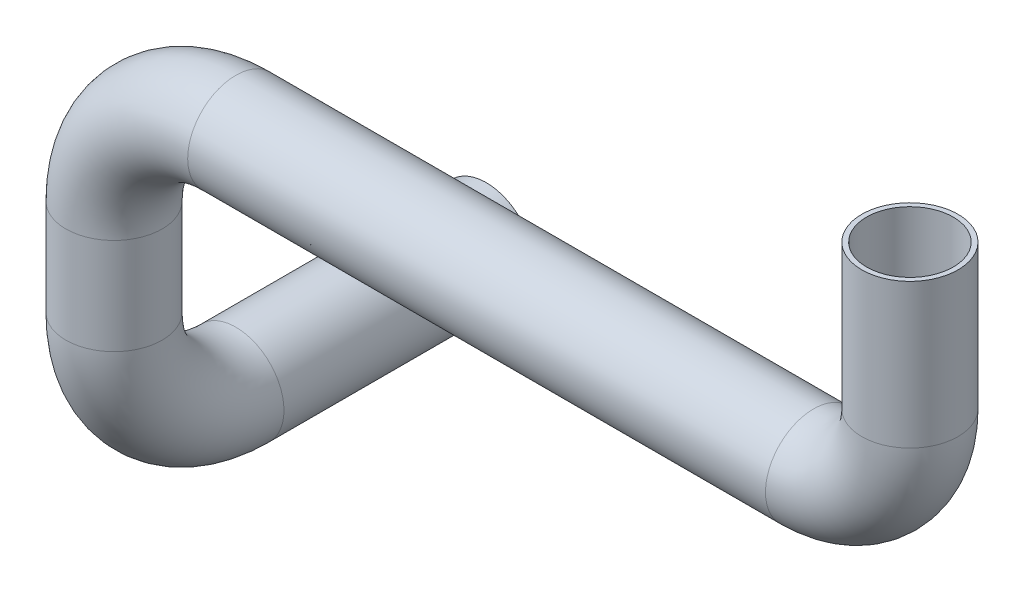
ISO-10303-21;
HEADER;
FILE_DESCRIPTION(('STEP AP214'),'2;1');
FILE_NAME('part.step','',(''),(''),'','','');
FILE_SCHEMA(('AUTOMOTIVE_DESIGN { 1 0 10303 214 1 1 1 1 }'));
ENDSEC;
DATA;
#1=APPLICATION_CONTEXT('core data for automotive mechanical design processes');
#2=APPLICATION_PROTOCOL_DEFINITION('international standard','automotive_design',2000,#1);
#3=PRODUCT_CONTEXT('',#1,'mechanical');
#4=PRODUCT('Part','Part','',(#3));
#5=PRODUCT_RELATED_PRODUCT_CATEGORY('part','',(#4));
#6=PRODUCT_DEFINITION_FORMATION('','',#4);
#7=PRODUCT_DEFINITION_CONTEXT('part definition',#1,'design');
#8=PRODUCT_DEFINITION('design','',#6,#7);
#9=PRODUCT_DEFINITION_SHAPE('','',#8);
#10=(LENGTH_UNIT() NAMED_UNIT(*) SI_UNIT(.MILLI.,.METRE.));
#11=(NAMED_UNIT(*) PLANE_ANGLE_UNIT() SI_UNIT($,.RADIAN.));
#12=(NAMED_UNIT(*) SI_UNIT($,.STERADIAN.) SOLID_ANGLE_UNIT());
#13=UNCERTAINTY_MEASURE_WITH_UNIT(LENGTH_MEASURE(1.E-05),#10,'distance_accuracy_value','');
#14=(GEOMETRIC_REPRESENTATION_CONTEXT(3) GLOBAL_UNCERTAINTY_ASSIGNED_CONTEXT((#13)) GLOBAL_UNIT_ASSIGNED_CONTEXT((#10,
#11,#12)) REPRESENTATION_CONTEXT('',''));
#15=CARTESIAN_POINT('',(0.,0.,0.));
#16=DIRECTION('',(0.,0.,1.));
#17=DIRECTION('',(1.,0.,0.));
#18=AXIS2_PLACEMENT_3D('',#15,#16,#17);
#19=CARTESIAN_POINT('',(-42.65,-12.65,0.));
#20=DIRECTION('',(0.,-1.,0.));
#21=DIRECTION('',(1.,0.,0.));
#22=AXIS2_PLACEMENT_3D('',#19,#20,#21);
#23=CYLINDRICAL_SURFACE('',#22,5.);
#24=CARTESIAN_POINT('',(-42.65,-12.65,0.));
#25=DIRECTION('',(0.,1.,0.));
#26=DIRECTION('',(0.,0.,1.));
#27=AXIS2_PLACEMENT_3D('',#24,#25,#26);
#28=CIRCLE('',#27,5.);
#29=CARTESIAN_POINT('',(-47.65,-12.65,0.));
#30=VERTEX_POINT('',#29);
#31=EDGE_CURVE('E10',#30,#30,#28,.T.);
#32=ORIENTED_EDGE('',*,*,#31,.F.);
#33=EDGE_LOOP('',(#32));
#34=FACE_BOUND('',#33,.T.);
#35=CARTESIAN_POINT('',(-42.65,-22.65,0.));
#36=DIRECTION('',(0.,-1.,0.));
#37=DIRECTION('',(1.,0.,0.));
#38=AXIS2_PLACEMENT_3D('',#35,#36,#37);
#39=CIRCLE('',#38,5.);
#40=CARTESIAN_POINT('',(-42.65,-22.65,4.99999999999999));
#41=VERTEX_POINT('',#40);
#42=EDGE_CURVE('E59',#41,#41,#39,.T.);
#43=ORIENTED_EDGE('',*,*,#42,.F.);
#44=EDGE_LOOP('',(#43));
#45=FACE_BOUND('',#44,.T.);
#46=ADVANCED_FACE('F31',(#34,#45),#23,.T.);
#47=CARTESIAN_POINT('',(-30.,-12.65,0.));
#48=DIRECTION('',(0.,0.,1.));
#49=DIRECTION('',(1.,0.,0.));
#50=AXIS2_PLACEMENT_3D('',#47,#48,#49);
#51=TOROIDAL_SURFACE('',#50,12.65,5.);
#52=CARTESIAN_POINT('',(-30.,0.,0.));
#53=DIRECTION('',(1.,0.,0.));
#54=DIRECTION('',(0.,0.,1.));
#55=AXIS2_PLACEMENT_3D('',#52,#53,#54);
#56=CIRCLE('',#55,5.);
#57=CARTESIAN_POINT('',(-30.,4.99999999999999,0.));
#58=VERTEX_POINT('',#57);
#59=EDGE_CURVE('E37',#58,#58,#56,.T.);
#60=CARTESIAN_POINT('',(-30.,-12.65,0.));
#61=DIRECTION('',(0.,0.,1.));
#62=DIRECTION('',(1.,0.,0.));
#63=AXIS2_PLACEMENT_3D('',#60,#61,#62);
#64=CIRCLE('',#63,17.65);
#65=EDGE_CURVE('',#58,#30,#64,.T.);
#66=ORIENTED_EDGE('',*,*,#59,.F.);
#67=ORIENTED_EDGE('',*,*,#31,.T.);
#68=ORIENTED_EDGE('',*,*,#65,.T.);
#69=ORIENTED_EDGE('',*,*,#65,.F.);
#70=EDGE_LOOP('',(#66,#68,#67,#69));
#71=FACE_BOUND('',#70,.T.);
#72=ADVANCED_FACE('F105',(#71),#51,.T.);
#73=CARTESIAN_POINT('',(30.,0.,0.));
#74=DIRECTION('',(-1.,0.,0.));
#75=DIRECTION('',(0.,-1.,0.));
#76=AXIS2_PLACEMENT_3D('',#73,#74,#75);
#77=CYLINDRICAL_SURFACE('',#76,5.);
#78=CARTESIAN_POINT('',(30.,0.,0.));
#79=DIRECTION('',(1.,0.,0.));
#80=DIRECTION('',(0.,0.,1.));
#81=AXIS2_PLACEMENT_3D('',#78,#79,#80);
#82=CIRCLE('',#81,5.);
#83=CARTESIAN_POINT('',(30.,-4.99999999999999,0.));
#84=VERTEX_POINT('',#83);
#85=EDGE_CURVE('E41',#84,#84,#82,.T.);
#86=ORIENTED_EDGE('',*,*,#85,.F.);
#87=EDGE_LOOP('',(#86));
#88=FACE_BOUND('',#87,.T.);
#89=ORIENTED_EDGE('',*,*,#59,.T.);
#90=EDGE_LOOP('',(#89));
#91=FACE_BOUND('',#90,.T.);
#92=ADVANCED_FACE('F110',(#88,#91),#77,.T.);
#93=CARTESIAN_POINT('',(30.,10.,0.));
#94=DIRECTION('',(0.,0.,-1.));
#95=DIRECTION('',(-1.,0.,0.));
#96=AXIS2_PLACEMENT_3D('',#93,#94,#95);
#97=TOROIDAL_SURFACE('',#96,9.99999999999999,5.);
#98=CARTESIAN_POINT('',(40.,10.,0.));
#99=DIRECTION('',(0.,1.,0.));
#100=DIRECTION('',(0.,0.,1.));
#101=AXIS2_PLACEMENT_3D('',#98,#99,#100);
#102=CIRCLE('',#101,5.);
#103=CARTESIAN_POINT('',(45.,10.,0.));
#104=VERTEX_POINT('',#103);
#105=EDGE_CURVE('E45',#104,#104,#102,.T.);
#106=CARTESIAN_POINT('',(30.,10.,0.));
#107=DIRECTION('',(0.,0.,-1.));
#108=DIRECTION('',(-1.,0.,0.));
#109=AXIS2_PLACEMENT_3D('',#106,#107,#108);
#110=CIRCLE('',#109,15.);
#111=EDGE_CURVE('',#104,#84,#110,.T.);
#112=ORIENTED_EDGE('',*,*,#105,.F.);
#113=ORIENTED_EDGE('',*,*,#85,.T.);
#114=ORIENTED_EDGE('',*,*,#111,.T.);
#115=ORIENTED_EDGE('',*,*,#111,.F.);
#116=EDGE_LOOP('',(#112,#114,#113,#115));
#117=FACE_BOUND('',#116,.T.);
#118=ADVANCED_FACE('F138',(#117),#97,.T.);
#119=CARTESIAN_POINT('',(40.,10.,0.));
#120=DIRECTION('',(0.,1.,0.));
#121=DIRECTION('',(-1.,0.,0.));
#122=AXIS2_PLACEMENT_3D('',#119,#120,#121);
#123=CYLINDRICAL_SURFACE('',#122,5.);
#124=ORIENTED_EDGE('',*,*,#105,.T.);
#125=EDGE_LOOP('',(#124));
#126=FACE_BOUND('',#125,.T.);
#127=CARTESIAN_POINT('',(40.,25.,0.));
#128=DIRECTION('',(0.,1.,0.));
#129=DIRECTION('',(0.,0.,1.));
#130=AXIS2_PLACEMENT_3D('',#127,#128,#129);
#131=CIRCLE('',#130,5.);
#132=CARTESIAN_POINT('',(40.,25.,5.));
#133=VERTEX_POINT('',#132);
#134=EDGE_CURVE('E48',#133,#133,#131,.T.);
#135=ORIENTED_EDGE('',*,*,#134,.F.);
#136=EDGE_LOOP('',(#135));
#137=FACE_BOUND('',#136,.T.);
#138=ADVANCED_FACE('F134',(#126,#137),#123,.T.);
#139=CARTESIAN_POINT('',(40.,25.,0.));
#140=DIRECTION('',(0.,1.,0.));
#141=DIRECTION('',(0.,0.,1.));
#142=AXIS2_PLACEMENT_3D('',#139,#140,#141);
#143=PLANE('',#142);
#144=CARTESIAN_POINT('',(40.,25.,0.));
#145=DIRECTION('',(0.,1.,0.));
#146=DIRECTION('',(0.,0.,1.));
#147=AXIS2_PLACEMENT_3D('',#144,#145,#146);
#148=CIRCLE('',#147,4.5);
#149=CARTESIAN_POINT('',(40.,25.,4.5));
#150=VERTEX_POINT('',#149);
#151=EDGE_CURVE('E66',#150,#150,#148,.T.);
#152=ORIENTED_EDGE('',*,*,#151,.F.);
#153=EDGE_LOOP('',(#152));
#154=FACE_BOUND('',#153,.T.);
#155=ORIENTED_EDGE('',*,*,#134,.T.);
#156=EDGE_LOOP('',(#155));
#157=FACE_BOUND('',#156,.T.);
#158=ADVANCED_FACE('F126',(#154,#157),#143,.T.);
#159=CARTESIAN_POINT('',(-42.65,-35.3,-12.65));
#160=DIRECTION('',(0.,0.,-1.));
#161=DIRECTION('',(0.,1.,0.));
#162=AXIS2_PLACEMENT_3D('',#159,#160,#161);
#163=CYLINDRICAL_SURFACE('',#162,5.);
#164=CARTESIAN_POINT('',(-42.65,-35.3,-12.65));
#165=DIRECTION('',(0.,0.,-1.));
#166=DIRECTION('',(1.,0.,0.));
#167=AXIS2_PLACEMENT_3D('',#164,#165,#166);
#168=CIRCLE('',#167,5.);
#169=CARTESIAN_POINT('',(-42.65,-40.3,-12.65));
#170=VERTEX_POINT('',#169);
#171=EDGE_CURVE('E56',#170,#170,#168,.T.);
#172=ORIENTED_EDGE('',*,*,#171,.T.);
#173=EDGE_LOOP('',(#172));
#174=FACE_BOUND('',#173,.T.);
#175=CARTESIAN_POINT('',(-42.65,-35.3,-38.65));
#176=DIRECTION('',(0.,0.,-1.));
#177=DIRECTION('',(1.,0.,0.));
#178=AXIS2_PLACEMENT_3D('',#175,#176,#177);
#179=CIRCLE('',#178,5.);
#180=CARTESIAN_POINT('',(-37.65,-35.3,-38.65));
#181=VERTEX_POINT('',#180);
#182=EDGE_CURVE('E51',#181,#181,#179,.T.);
#183=ORIENTED_EDGE('',*,*,#182,.F.);
#184=EDGE_LOOP('',(#183));
#185=FACE_BOUND('',#184,.T.);
#186=ADVANCED_FACE('F117',(#174,#185),#163,.T.);
#187=CARTESIAN_POINT('',(-42.65,-22.65,-12.65));
#188=DIRECTION('',(-1.,0.,0.));
#189=DIRECTION('',(0.,0.,1.));
#190=AXIS2_PLACEMENT_3D('',#187,#188,#189);
#191=TOROIDAL_SURFACE('',#190,12.65,5.);
#192=CARTESIAN_POINT('',(-42.65,-22.65,-12.65));
#193=DIRECTION('',(-1.,0.,0.));
#194=DIRECTION('',(0.,0.,1.));
#195=AXIS2_PLACEMENT_3D('',#192,#193,#194);
#196=CIRCLE('',#195,17.65);
#197=EDGE_CURVE('',#170,#41,#196,.T.);
#198=ORIENTED_EDGE('',*,*,#171,.F.);
#199=ORIENTED_EDGE('',*,*,#42,.T.);
#200=ORIENTED_EDGE('',*,*,#197,.T.);
#201=ORIENTED_EDGE('',*,*,#197,.F.);
#202=EDGE_LOOP('',(#198,#200,#199,#201));
#203=FACE_BOUND('',#202,.T.);
#204=ADVANCED_FACE('F115',(#203),#191,.T.);
#205=CARTESIAN_POINT('',(-42.65,-35.3,-38.65));
#206=DIRECTION('',(0.,0.,-1.));
#207=DIRECTION('',(1.,0.,0.));
#208=AXIS2_PLACEMENT_3D('',#205,#206,#207);
#209=PLANE('',#208);
#210=CARTESIAN_POINT('',(-42.65,-35.3,-38.65));
#211=DIRECTION('',(0.,0.,-1.));
#212=DIRECTION('',(-1.,0.,0.));
#213=AXIS2_PLACEMENT_3D('',#210,#211,#212);
#214=CIRCLE('',#213,4.5);
#215=CARTESIAN_POINT('',(-47.15,-35.3,-38.65));
#216=VERTEX_POINT('',#215);
#217=EDGE_CURVE('E63',#216,#216,#214,.T.);
#218=ORIENTED_EDGE('',*,*,#217,.F.);
#219=EDGE_LOOP('',(#218));
#220=FACE_BOUND('',#219,.T.);
#221=ORIENTED_EDGE('',*,*,#182,.T.);
#222=EDGE_LOOP('',(#221));
#223=FACE_BOUND('',#222,.T.);
#224=ADVANCED_FACE('F102',(#220,#223),#209,.T.);
#225=CARTESIAN_POINT('',(-42.65,-12.65,0.));
#226=DIRECTION('',(0.,-1.,0.));
#227=DIRECTION('',(1.,0.,0.));
#228=AXIS2_PLACEMENT_3D('',#225,#226,#227);
#229=CYLINDRICAL_SURFACE('',#228,4.5);
#230=CARTESIAN_POINT('',(-42.65,-12.65,0.));
#231=DIRECTION('',(0.,1.,0.));
#232=DIRECTION('',(-1.,0.,0.));
#233=AXIS2_PLACEMENT_3D('',#230,#231,#232);
#234=CIRCLE('',#233,4.5);
#235=CARTESIAN_POINT('',(-47.15,-12.65,0.));
#236=VERTEX_POINT('',#235);
#237=EDGE_CURVE('E62',#236,#236,#234,.T.);
#238=ORIENTED_EDGE('',*,*,#237,.T.);
#239=EDGE_LOOP('',(#238));
#240=FACE_BOUND('',#239,.T.);
#241=CARTESIAN_POINT('',(-42.65,-22.65,0.));
#242=DIRECTION('',(0.,-1.,0.));
#243=DIRECTION('',(0.,0.,-1.));
#244=AXIS2_PLACEMENT_3D('',#241,#242,#243);
#245=CIRCLE('',#244,4.5);
#246=CARTESIAN_POINT('',(-42.65,-22.65,4.49999999999999));
#247=VERTEX_POINT('',#246);
#248=EDGE_CURVE('E73',#247,#247,#245,.T.);
#249=ORIENTED_EDGE('',*,*,#248,.T.);
#250=EDGE_LOOP('',(#249));
#251=FACE_BOUND('',#250,.T.);
#252=ADVANCED_FACE('F87',(#240,#251),#229,.F.);
#253=CARTESIAN_POINT('',(-30.,-12.65,0.));
#254=DIRECTION('',(0.,0.,1.));
#255=DIRECTION('',(1.,0.,0.));
#256=AXIS2_PLACEMENT_3D('',#253,#254,#255);
#257=TOROIDAL_SURFACE('',#256,12.65,4.5);
#258=CARTESIAN_POINT('',(-30.,0.,0.));
#259=DIRECTION('',(-1.,0.,0.));
#260=DIRECTION('',(0.,-1.,0.));
#261=AXIS2_PLACEMENT_3D('',#258,#259,#260);
#262=CIRCLE('',#261,4.5);
#263=CARTESIAN_POINT('',(-30.,4.49999999999999,0.));
#264=VERTEX_POINT('',#263);
#265=EDGE_CURVE('E79',#264,#264,#262,.F.);
#266=CARTESIAN_POINT('',(-30.,-12.65,0.));
#267=DIRECTION('',(0.,0.,1.));
#268=DIRECTION('',(1.,0.,0.));
#269=AXIS2_PLACEMENT_3D('',#266,#267,#268);
#270=CIRCLE('',#269,17.15);
#271=EDGE_CURVE('',#264,#236,#270,.T.);
#272=ORIENTED_EDGE('',*,*,#265,.T.);
#273=ORIENTED_EDGE('',*,*,#237,.F.);
#274=ORIENTED_EDGE('',*,*,#271,.T.);
#275=ORIENTED_EDGE('',*,*,#271,.F.);
#276=EDGE_LOOP('',(#272,#274,#273,#275));
#277=FACE_BOUND('',#276,.T.);
#278=ADVANCED_FACE('F90',(#277),#257,.F.);
#279=CARTESIAN_POINT('',(30.,0.,0.));
#280=DIRECTION('',(-1.,0.,0.));
#281=DIRECTION('',(0.,-1.,0.));
#282=AXIS2_PLACEMENT_3D('',#279,#280,#281);
#283=CYLINDRICAL_SURFACE('',#282,4.5);
#284=CARTESIAN_POINT('',(30.,0.,0.));
#285=DIRECTION('',(1.,0.,0.));
#286=DIRECTION('',(0.,1.,0.));
#287=AXIS2_PLACEMENT_3D('',#284,#285,#286);
#288=CIRCLE('',#287,4.5);
#289=CARTESIAN_POINT('',(30.,-4.49999999999999,0.));
#290=VERTEX_POINT('',#289);
#291=EDGE_CURVE('E76',#290,#290,#288,.T.);
#292=ORIENTED_EDGE('',*,*,#291,.T.);
#293=EDGE_LOOP('',(#292));
#294=FACE_BOUND('',#293,.T.);
#295=ORIENTED_EDGE('',*,*,#265,.F.);
#296=EDGE_LOOP('',(#295));
#297=FACE_BOUND('',#296,.T.);
#298=ADVANCED_FACE('F92',(#294,#297),#283,.F.);
#299=CARTESIAN_POINT('',(30.,10.,0.));
#300=DIRECTION('',(0.,0.,-1.));
#301=DIRECTION('',(-1.,0.,0.));
#302=AXIS2_PLACEMENT_3D('',#299,#300,#301);
#303=TOROIDAL_SURFACE('',#302,9.99999999999999,4.5);
#304=CARTESIAN_POINT('',(40.,10.,0.));
#305=DIRECTION('',(0.,1.,0.));
#306=DIRECTION('',(-1.,0.,0.));
#307=AXIS2_PLACEMENT_3D('',#304,#305,#306);
#308=CIRCLE('',#307,4.5);
#309=CARTESIAN_POINT('',(44.5,10.,0.));
#310=VERTEX_POINT('',#309);
#311=EDGE_CURVE('E70',#310,#310,#308,.T.);
#312=CARTESIAN_POINT('',(30.,10.,0.));
#313=DIRECTION('',(0.,0.,-1.));
#314=DIRECTION('',(-1.,0.,0.));
#315=AXIS2_PLACEMENT_3D('',#312,#313,#314);
#316=CIRCLE('',#315,14.5);
#317=EDGE_CURVE('',#310,#290,#316,.T.);
#318=ORIENTED_EDGE('',*,*,#311,.T.);
#319=ORIENTED_EDGE('',*,*,#291,.F.);
#320=ORIENTED_EDGE('',*,*,#317,.T.);
#321=ORIENTED_EDGE('',*,*,#317,.F.);
#322=EDGE_LOOP('',(#318,#320,#319,#321));
#323=FACE_BOUND('',#322,.T.);
#324=ADVANCED_FACE('F99',(#323),#303,.F.);
#325=CARTESIAN_POINT('',(40.,10.,0.));
#326=DIRECTION('',(0.,1.,0.));
#327=DIRECTION('',(-1.,0.,0.));
#328=AXIS2_PLACEMENT_3D('',#325,#326,#327);
#329=CYLINDRICAL_SURFACE('',#328,4.5);
#330=ORIENTED_EDGE('',*,*,#311,.F.);
#331=EDGE_LOOP('',(#330));
#332=FACE_BOUND('',#331,.T.);
#333=ORIENTED_EDGE('',*,*,#151,.T.);
#334=EDGE_LOOP('',(#333));
#335=FACE_BOUND('',#334,.T.);
#336=ADVANCED_FACE('F200',(#332,#335),#329,.F.);
#337=CARTESIAN_POINT('',(-42.65,-35.3,-12.65));
#338=DIRECTION('',(0.,0.,-1.));
#339=DIRECTION('',(0.,1.,0.));
#340=AXIS2_PLACEMENT_3D('',#337,#338,#339);
#341=CYLINDRICAL_SURFACE('',#340,4.5);
#342=CARTESIAN_POINT('',(-42.65,-35.3,-12.65));
#343=DIRECTION('',(0.,0.,-1.));
#344=DIRECTION('',(0.,1.,0.));
#345=AXIS2_PLACEMENT_3D('',#342,#343,#344);
#346=CIRCLE('',#345,4.5);
#347=CARTESIAN_POINT('',(-42.65,-39.8,-12.65));
#348=VERTEX_POINT('',#347);
#349=EDGE_CURVE('E67',#348,#348,#346,.T.);
#350=ORIENTED_EDGE('',*,*,#349,.F.);
#351=EDGE_LOOP('',(#350));
#352=FACE_BOUND('',#351,.T.);
#353=ORIENTED_EDGE('',*,*,#217,.T.);
#354=EDGE_LOOP('',(#353));
#355=FACE_BOUND('',#354,.T.);
#356=ADVANCED_FACE('F209',(#352,#355),#341,.F.);
#357=CARTESIAN_POINT('',(-42.65,-22.65,-12.65));
#358=DIRECTION('',(-1.,0.,0.));
#359=DIRECTION('',(0.,0.,1.));
#360=AXIS2_PLACEMENT_3D('',#357,#358,#359);
#361=TOROIDAL_SURFACE('',#360,12.65,4.5);
#362=CARTESIAN_POINT('',(-42.65,-22.65,-12.65));
#363=DIRECTION('',(-1.,0.,0.));
#364=DIRECTION('',(0.,0.,1.));
#365=AXIS2_PLACEMENT_3D('',#362,#363,#364);
#366=CIRCLE('',#365,17.15);
#367=EDGE_CURVE('',#348,#247,#366,.T.);
#368=ORIENTED_EDGE('',*,*,#349,.T.);
#369=ORIENTED_EDGE('',*,*,#248,.F.);
#370=ORIENTED_EDGE('',*,*,#367,.T.);
#371=ORIENTED_EDGE('',*,*,#367,.F.);
#372=EDGE_LOOP('',(#368,#370,#369,#371));
#373=FACE_BOUND('',#372,.T.);
#374=ADVANCED_FACE('F218',(#373),#361,.F.);
#375=CLOSED_SHELL('',(#46,#72,#92,#118,#138,#158,#186,#204,#224,#252,#278,#298,#324,#336,#356,#374));
#376=MANIFOLD_SOLID_BREP('B2',#375);
#377=ADVANCED_BREP_SHAPE_REPRESENTATION('',(#18,#376),#14);
#378=SHAPE_DEFINITION_REPRESENTATION(#9,#377);
ENDSEC;
END-ISO-10303-21;
